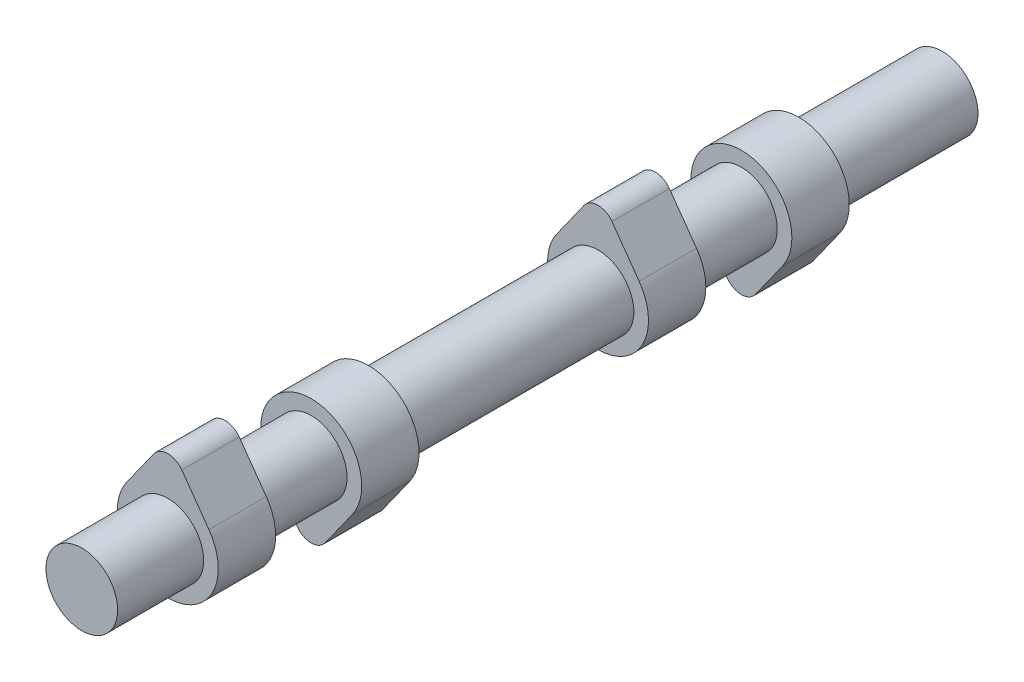
ISO-10303-21;
HEADER;
FILE_DESCRIPTION(('STEP AP214'),'2;1');
FILE_NAME('part.step','',(''),(''),'','','');
FILE_SCHEMA(('AUTOMOTIVE_DESIGN { 1 0 10303 214 1 1 1 1 }'));
ENDSEC;
DATA;
#1=APPLICATION_CONTEXT('core data for automotive mechanical design processes');
#2=APPLICATION_PROTOCOL_DEFINITION('international standard','automotive_design',2000,#1);
#3=PRODUCT_CONTEXT('',#1,'mechanical');
#4=PRODUCT('Part','Part','',(#3));
#5=PRODUCT_RELATED_PRODUCT_CATEGORY('part','',(#4));
#6=PRODUCT_DEFINITION_FORMATION('','',#4);
#7=PRODUCT_DEFINITION_CONTEXT('part definition',#1,'design');
#8=PRODUCT_DEFINITION('design','',#6,#7);
#9=PRODUCT_DEFINITION_SHAPE('','',#8);
#10=(LENGTH_UNIT() NAMED_UNIT(*) SI_UNIT(.MILLI.,.METRE.));
#11=(NAMED_UNIT(*) PLANE_ANGLE_UNIT() SI_UNIT($,.RADIAN.));
#12=(NAMED_UNIT(*) SI_UNIT($,.STERADIAN.) SOLID_ANGLE_UNIT());
#13=UNCERTAINTY_MEASURE_WITH_UNIT(LENGTH_MEASURE(1.E-05),#10,'distance_accuracy_value','');
#14=(GEOMETRIC_REPRESENTATION_CONTEXT(3) GLOBAL_UNCERTAINTY_ASSIGNED_CONTEXT((#13)) GLOBAL_UNIT_ASSIGNED_CONTEXT((#10,
#11,#12)) REPRESENTATION_CONTEXT('',''));
#15=CARTESIAN_POINT('',(0.,0.,0.));
#16=DIRECTION('',(0.,0.,1.));
#17=DIRECTION('',(1.,0.,0.));
#18=AXIS2_PLACEMENT_3D('',#15,#16,#17);
#19=CARTESIAN_POINT('',(0.,0.,150.));
#20=DIRECTION('',(0.,0.,-1.));
#21=DIRECTION('',(-1.,0.,0.));
#22=AXIS2_PLACEMENT_3D('',#19,#20,#21);
#23=CYLINDRICAL_SURFACE('',#22,6.25);
#24=CARTESIAN_POINT('',(0.,0.,50.));
#25=DIRECTION('',(0.,0.,-1.));
#26=DIRECTION('',(-1.,0.,0.));
#27=AXIS2_PLACEMENT_3D('',#24,#25,#26);
#28=CIRCLE('',#27,6.25);
#29=CARTESIAN_POINT('',(-6.25,0.,50.));
#30=VERTEX_POINT('',#29);
#31=EDGE_CURVE('E218',#30,#30,#28,.T.);
#32=ORIENTED_EDGE('',*,*,#31,.T.);
#33=EDGE_LOOP('',(#32));
#34=FACE_BOUND('',#33,.T.);
#35=CARTESIAN_POINT('',(0.,0.,35.));
#36=DIRECTION('',(0.,0.,-1.));
#37=DIRECTION('',(-1.,0.,0.));
#38=AXIS2_PLACEMENT_3D('',#35,#36,#37);
#39=CIRCLE('',#38,6.25);
#40=CARTESIAN_POINT('',(-6.25,0.,35.));
#41=VERTEX_POINT('',#40);
#42=EDGE_CURVE('E11',#41,#41,#39,.T.);
#43=ORIENTED_EDGE('',*,*,#42,.F.);
#44=EDGE_LOOP('',(#43));
#45=FACE_BOUND('',#44,.T.);
#46=ADVANCED_FACE('F33',(#34,#45),#23,.T.);
#47=CARTESIAN_POINT('',(0.,0.,100.));
#48=DIRECTION('',(0.,0.,-1.));
#49=DIRECTION('',(-1.,0.,0.));
#50=AXIS2_PLACEMENT_3D('',#47,#48,#49);
#51=CIRCLE('',#50,6.25);
#52=CARTESIAN_POINT('',(-6.25,0.,100.));
#53=VERTEX_POINT('',#52);
#54=EDGE_CURVE('E219',#53,#53,#51,.T.);
#55=ORIENTED_EDGE('',*,*,#54,.T.);
#56=EDGE_LOOP('',(#55));
#57=FACE_BOUND('',#56,.T.);
#58=CARTESIAN_POINT('',(0.,0.,60.));
#59=DIRECTION('',(0.,0.,-1.));
#60=DIRECTION('',(-1.,0.,0.));
#61=AXIS2_PLACEMENT_3D('',#58,#59,#60);
#62=CIRCLE('',#61,6.25);
#63=CARTESIAN_POINT('',(-6.25,0.,60.));
#64=VERTEX_POINT('',#63);
#65=EDGE_CURVE('E43',#64,#64,#62,.T.);
#66=ORIENTED_EDGE('',*,*,#65,.F.);
#67=EDGE_LOOP('',(#66));
#68=FACE_BOUND('',#67,.T.);
#69=ADVANCED_FACE('F331',(#57,#68),#23,.T.);
#70=CARTESIAN_POINT('',(0.,0.,125.));
#71=DIRECTION('',(0.,0.,1.));
#72=DIRECTION('',(1.,0.,0.));
#73=AXIS2_PLACEMENT_3D('',#70,#71,#72);
#74=CIRCLE('',#73,6.25);
#75=CARTESIAN_POINT('',(6.25,0.,125.));
#76=VERTEX_POINT('',#75);
#77=EDGE_CURVE('E283',#76,#76,#74,.T.);
#78=ORIENTED_EDGE('',*,*,#77,.F.);
#79=EDGE_LOOP('',(#78));
#80=FACE_BOUND('',#79,.T.);
#81=CARTESIAN_POINT('',(0.,0.,110.));
#82=DIRECTION('',(0.,0.,-1.));
#83=DIRECTION('',(-1.,0.,0.));
#84=AXIS2_PLACEMENT_3D('',#81,#82,#83);
#85=CIRCLE('',#84,6.25);
#86=CARTESIAN_POINT('',(-6.25,0.,110.));
#87=VERTEX_POINT('',#86);
#88=EDGE_CURVE('E288',#87,#87,#85,.T.);
#89=ORIENTED_EDGE('',*,*,#88,.F.);
#90=EDGE_LOOP('',(#89));
#91=FACE_BOUND('',#90,.T.);
#92=ADVANCED_FACE('F335',(#80,#91),#23,.T.);
#93=CARTESIAN_POINT('',(0.,10.,125.));
#94=DIRECTION('',(0.,0.,1.));
#95=DIRECTION('',(1.,0.,0.));
#96=AXIS2_PLACEMENT_3D('',#93,#94,#95);
#97=CYLINDRICAL_SURFACE('',#96,3.);
#98=CARTESIAN_POINT('',(0.,10.,135.));
#99=DIRECTION('',(0.,0.,1.));
#100=DIRECTION('',(1.,0.,0.));
#101=AXIS2_PLACEMENT_3D('',#98,#99,#100);
#102=CIRCLE('',#101,3.);
#103=CARTESIAN_POINT('',(2.44384942252996,11.74,135.));
#104=VERTEX_POINT('',#103);
#105=CARTESIAN_POINT('',(-2.44384942252996,11.74,135.));
#106=VERTEX_POINT('',#105);
#107=EDGE_CURVE('E255',#104,#106,#102,.T.);
#108=ORIENTED_EDGE('',*,*,#107,.F.);
#109=DIRECTION('',(0.,0.,1.));
#110=VECTOR('',#109,1.);
#111=CARTESIAN_POINT('',(2.44384942252996,11.74,125.));
#112=LINE('',#111,#110);
#113=CARTESIAN_POINT('',(2.44384942252996,11.74,125.));
#114=VERTEX_POINT('',#113);
#115=EDGE_CURVE('E51',#114,#104,#112,.T.);
#116=ORIENTED_EDGE('',*,*,#115,.F.);
#117=CARTESIAN_POINT('',(0.,10.,125.));
#118=DIRECTION('',(0.,0.,1.));
#119=DIRECTION('',(1.,0.,0.));
#120=AXIS2_PLACEMENT_3D('',#117,#118,#119);
#121=CIRCLE('',#120,3.);
#122=CARTESIAN_POINT('',(-2.44384942252996,11.74,125.));
#123=VERTEX_POINT('',#122);
#124=EDGE_CURVE('E256',#114,#123,#121,.T.);
#125=ORIENTED_EDGE('',*,*,#124,.T.);
#126=DIRECTION('',(0.,0.,1.));
#127=VECTOR('',#126,1.);
#128=CARTESIAN_POINT('',(-2.44384942252996,11.74,125.));
#129=LINE('',#128,#127);
#130=EDGE_CURVE('E80',#123,#106,#129,.T.);
#131=ORIENTED_EDGE('',*,*,#130,.T.);
#132=EDGE_LOOP('',(#108,#116,#125,#131));
#133=FACE_BOUND('',#132,.T.);
#134=ADVANCED_FACE('F363',(#133),#97,.T.);
#135=CARTESIAN_POINT('',(2.44384942252996,11.74,125.));
#136=DIRECTION('',(0.814616474176652,0.58,0.));
#137=DIRECTION('',(-0.58,0.814616474176652,0.));
#138=AXIS2_PLACEMENT_3D('',#135,#136,#137);
#139=PLANE('',#138);
#140=DIRECTION('',(-0.58,0.814616474176652,0.));
#141=VECTOR('',#140,1.);
#142=CARTESIAN_POINT('',(2.44384942252996,11.74,135.));
#143=LINE('',#142,#141);
#144=CARTESIAN_POINT('',(7.16862497275454,5.104,135.));
#145=VERTEX_POINT('',#144);
#146=EDGE_CURVE('E259',#145,#104,#143,.T.);
#147=ORIENTED_EDGE('',*,*,#146,.F.);
#148=DIRECTION('',(0.,0.,1.));
#149=VECTOR('',#148,1.);
#150=CARTESIAN_POINT('',(7.16862497275454,5.104,125.));
#151=LINE('',#150,#149);
#152=CARTESIAN_POINT('',(7.16862497275454,5.104,125.));
#153=VERTEX_POINT('',#152);
#154=EDGE_CURVE('E69',#153,#145,#151,.T.);
#155=ORIENTED_EDGE('',*,*,#154,.F.);
#156=DIRECTION('',(-0.58,0.814616474176652,0.));
#157=VECTOR('',#156,1.);
#158=CARTESIAN_POINT('',(2.44384942252996,11.74,125.));
#159=LINE('',#158,#157);
#160=EDGE_CURVE('E263',#153,#114,#159,.T.);
#161=ORIENTED_EDGE('',*,*,#160,.T.);
#162=ORIENTED_EDGE('',*,*,#115,.T.);
#163=EDGE_LOOP('',(#147,#155,#161,#162));
#164=FACE_BOUND('',#163,.T.);
#165=ADVANCED_FACE('F368',(#164),#139,.T.);
#166=CARTESIAN_POINT('',(0.,0.,125.));
#167=DIRECTION('',(0.,0.,1.));
#168=DIRECTION('',(1.,0.,0.));
#169=AXIS2_PLACEMENT_3D('',#166,#167,#168);
#170=CYLINDRICAL_SURFACE('',#169,8.8);
#171=CARTESIAN_POINT('',(0.,0.,135.));
#172=DIRECTION('',(0.,0.,1.));
#173=DIRECTION('',(1.,0.,0.));
#174=AXIS2_PLACEMENT_3D('',#171,#172,#173);
#175=CIRCLE('',#174,8.8);
#176=CARTESIAN_POINT('',(-7.16862497275454,5.104,135.));
#177=VERTEX_POINT('',#176);
#178=EDGE_CURVE('E270',#177,#145,#175,.T.);
#179=ORIENTED_EDGE('',*,*,#178,.F.);
#180=DIRECTION('',(0.,0.,1.));
#181=VECTOR('',#180,1.);
#182=CARTESIAN_POINT('',(-7.16862497275454,5.104,125.));
#183=LINE('',#182,#181);
#184=CARTESIAN_POINT('',(-7.16862497275454,5.104,125.));
#185=VERTEX_POINT('',#184);
#186=EDGE_CURVE('E277',#185,#177,#183,.T.);
#187=ORIENTED_EDGE('',*,*,#186,.F.);
#188=CARTESIAN_POINT('',(0.,0.,125.));
#189=DIRECTION('',(0.,0.,1.));
#190=DIRECTION('',(1.,0.,0.));
#191=AXIS2_PLACEMENT_3D('',#188,#189,#190);
#192=CIRCLE('',#191,8.8);
#193=EDGE_CURVE('E261',#185,#153,#192,.T.);
#194=ORIENTED_EDGE('',*,*,#193,.T.);
#195=ORIENTED_EDGE('',*,*,#154,.T.);
#196=EDGE_LOOP('',(#179,#187,#194,#195));
#197=FACE_BOUND('',#196,.T.);
#198=ADVANCED_FACE('F408',(#197),#170,.T.);
#199=CARTESIAN_POINT('',(-2.44384942252996,11.74,125.));
#200=DIRECTION('',(-0.814616474176652,0.58,0.));
#201=DIRECTION('',(-0.58,-0.814616474176652,0.));
#202=AXIS2_PLACEMENT_3D('',#199,#200,#201);
#203=PLANE('',#202);
#204=DIRECTION('',(-0.58,-0.814616474176652,0.));
#205=VECTOR('',#204,1.);
#206=CARTESIAN_POINT('',(-2.44384942252996,11.74,135.));
#207=LINE('',#206,#205);
#208=EDGE_CURVE('E267',#106,#177,#207,.T.);
#209=ORIENTED_EDGE('',*,*,#208,.F.);
#210=ORIENTED_EDGE('',*,*,#130,.F.);
#211=DIRECTION('',(-0.58,-0.814616474176652,0.));
#212=VECTOR('',#211,1.);
#213=CARTESIAN_POINT('',(-2.44384942252996,11.74,125.));
#214=LINE('',#213,#212);
#215=EDGE_CURVE('E258',#123,#185,#214,.T.);
#216=ORIENTED_EDGE('',*,*,#215,.T.);
#217=ORIENTED_EDGE('',*,*,#186,.T.);
#218=EDGE_LOOP('',(#209,#210,#216,#217));
#219=FACE_BOUND('',#218,.T.);
#220=ADVANCED_FACE('F401',(#219),#203,.T.);
#221=CARTESIAN_POINT('',(0.,10.,125.));
#222=DIRECTION('',(0.,0.,1.));
#223=DIRECTION('',(1.,0.,0.));
#224=AXIS2_PLACEMENT_3D('',#221,#222,#223);
#225=PLANE('',#224);
#226=ORIENTED_EDGE('',*,*,#77,.T.);
#227=EDGE_LOOP('',(#226));
#228=FACE_BOUND('',#227,.T.);
#229=ORIENTED_EDGE('',*,*,#124,.F.);
#230=ORIENTED_EDGE('',*,*,#160,.F.);
#231=ORIENTED_EDGE('',*,*,#193,.F.);
#232=ORIENTED_EDGE('',*,*,#215,.F.);
#233=EDGE_LOOP('',(#229,#230,#231,#232));
#234=FACE_BOUND('',#233,.T.);
#235=ADVANCED_FACE('F398',(#228,#234),#225,.F.);
#236=CARTESIAN_POINT('',(0.,10.,135.));
#237=DIRECTION('',(0.,0.,1.));
#238=DIRECTION('',(1.,0.,0.));
#239=AXIS2_PLACEMENT_3D('',#236,#237,#238);
#240=PLANE('',#239);
#241=CARTESIAN_POINT('',(0.,0.,135.));
#242=DIRECTION('',(0.,0.,1.));
#243=DIRECTION('',(1.,0.,0.));
#244=AXIS2_PLACEMENT_3D('',#241,#242,#243);
#245=CIRCLE('',#244,6.25);
#246=CARTESIAN_POINT('',(6.25,0.,135.));
#247=VERTEX_POINT('',#246);
#248=EDGE_CURVE('E252',#247,#247,#245,.T.);
#249=ORIENTED_EDGE('',*,*,#248,.F.);
#250=EDGE_LOOP('',(#249));
#251=FACE_BOUND('',#250,.T.);
#252=ORIENTED_EDGE('',*,*,#107,.T.);
#253=ORIENTED_EDGE('',*,*,#208,.T.);
#254=ORIENTED_EDGE('',*,*,#178,.T.);
#255=ORIENTED_EDGE('',*,*,#146,.T.);
#256=EDGE_LOOP('',(#252,#253,#254,#255));
#257=FACE_BOUND('',#256,.T.);
#258=ADVANCED_FACE('F349',(#251,#257),#240,.T.);
#259=CARTESIAN_POINT('',(0.,0.,150.));
#260=DIRECTION('',(0.,0.,1.));
#261=DIRECTION('',(1.,0.,0.));
#262=AXIS2_PLACEMENT_3D('',#259,#260,#261);
#263=PLANE('',#262);
#264=CARTESIAN_POINT('',(0.,0.,150.));
#265=DIRECTION('',(0.,0.,1.));
#266=DIRECTION('',(1.,0.,0.));
#267=AXIS2_PLACEMENT_3D('',#264,#265,#266);
#268=CIRCLE('',#267,6.25);
#269=CARTESIAN_POINT('',(6.25,0.,150.));
#270=VERTEX_POINT('',#269);
#271=EDGE_CURVE('E280',#270,#270,#268,.T.);
#272=ORIENTED_EDGE('',*,*,#271,.T.);
#273=EDGE_LOOP('',(#272));
#274=FACE_BOUND('',#273,.T.);
#275=ADVANCED_FACE('F339',(#274),#263,.T.);
#276=ORIENTED_EDGE('',*,*,#248,.T.);
#277=EDGE_LOOP('',(#276));
#278=FACE_BOUND('',#277,.T.);
#279=ORIENTED_EDGE('',*,*,#271,.F.);
#280=EDGE_LOOP('',(#279));
#281=FACE_BOUND('',#280,.T.);
#282=ADVANCED_FACE('F35',(#278,#281),#23,.T.);
#283=CARTESIAN_POINT('',(0.,-10.,100.));
#284=DIRECTION('',(0.,0.,-1.));
#285=DIRECTION('',(-1.,0.,0.));
#286=AXIS2_PLACEMENT_3D('',#283,#284,#285);
#287=PLANE('',#286);
#288=CARTESIAN_POINT('',(0.,-10.,100.));
#289=DIRECTION('',(0.,0.,-1.));
#290=DIRECTION('',(-1.,0.,0.));
#291=AXIS2_PLACEMENT_3D('',#288,#289,#290);
#292=CIRCLE('',#291,3.);
#293=CARTESIAN_POINT('',(2.44384942252996,-11.74,100.));
#294=VERTEX_POINT('',#293);
#295=CARTESIAN_POINT('',(-2.44384942252996,-11.74,100.));
#296=VERTEX_POINT('',#295);
#297=EDGE_CURVE('E223',#294,#296,#292,.T.);
#298=ORIENTED_EDGE('',*,*,#297,.T.);
#299=DIRECTION('',(-0.58,0.814616474176652,0.));
#300=VECTOR('',#299,1.);
#301=CARTESIAN_POINT('',(-2.44384942252996,-11.74,100.));
#302=LINE('',#301,#300);
#303=CARTESIAN_POINT('',(-7.16862497275454,-5.104,100.));
#304=VERTEX_POINT('',#303);
#305=EDGE_CURVE('E226',#296,#304,#302,.T.);
#306=ORIENTED_EDGE('',*,*,#305,.T.);
#307=CARTESIAN_POINT('',(0.,0.,100.));
#308=DIRECTION('',(0.,0.,-1.));
#309=DIRECTION('',(-1.,0.,0.));
#310=AXIS2_PLACEMENT_3D('',#307,#308,#309);
#311=CIRCLE('',#310,8.8);
#312=CARTESIAN_POINT('',(7.16862497275454,-5.104,100.));
#313=VERTEX_POINT('',#312);
#314=EDGE_CURVE('E229',#304,#313,#311,.T.);
#315=ORIENTED_EDGE('',*,*,#314,.T.);
#316=DIRECTION('',(-0.58,-0.814616474176652,0.));
#317=VECTOR('',#316,1.);
#318=CARTESIAN_POINT('',(2.44384942252996,-11.74,100.));
#319=LINE('',#318,#317);
#320=EDGE_CURVE('E231',#313,#294,#319,.T.);
#321=ORIENTED_EDGE('',*,*,#320,.T.);
#322=EDGE_LOOP('',(#298,#306,#315,#321));
#323=FACE_BOUND('',#322,.T.);
#324=ORIENTED_EDGE('',*,*,#54,.F.);
#325=EDGE_LOOP('',(#324));
#326=FACE_BOUND('',#325,.T.);
#327=ADVANCED_FACE('F338',(#323,#326),#287,.T.);
#328=CARTESIAN_POINT('',(0.,-10.,110.));
#329=DIRECTION('',(0.,0.,-1.));
#330=DIRECTION('',(-1.,0.,0.));
#331=AXIS2_PLACEMENT_3D('',#328,#329,#330);
#332=PLANE('',#331);
#333=CARTESIAN_POINT('',(0.,-10.,110.));
#334=DIRECTION('',(0.,0.,-1.));
#335=DIRECTION('',(-1.,0.,0.));
#336=AXIS2_PLACEMENT_3D('',#333,#334,#335);
#337=CIRCLE('',#336,3.);
#338=CARTESIAN_POINT('',(2.44384942252996,-11.74,110.));
#339=VERTEX_POINT('',#338);
#340=CARTESIAN_POINT('',(-2.44384942252996,-11.74,110.));
#341=VERTEX_POINT('',#340);
#342=EDGE_CURVE('E222',#339,#341,#337,.T.);
#343=ORIENTED_EDGE('',*,*,#342,.F.);
#344=DIRECTION('',(-0.58,-0.814616474176652,0.));
#345=VECTOR('',#344,1.);
#346=CARTESIAN_POINT('',(2.44384942252996,-11.74,110.));
#347=LINE('',#346,#345);
#348=CARTESIAN_POINT('',(7.16862497275454,-5.104,110.));
#349=VERTEX_POINT('',#348);
#350=EDGE_CURVE('E227',#349,#339,#347,.T.);
#351=ORIENTED_EDGE('',*,*,#350,.F.);
#352=CARTESIAN_POINT('',(0.,0.,110.));
#353=DIRECTION('',(0.,0.,-1.));
#354=DIRECTION('',(-1.,0.,0.));
#355=AXIS2_PLACEMENT_3D('',#352,#353,#354);
#356=CIRCLE('',#355,8.8);
#357=CARTESIAN_POINT('',(-7.16862497275454,-5.104,110.));
#358=VERTEX_POINT('',#357);
#359=EDGE_CURVE('E238',#358,#349,#356,.T.);
#360=ORIENTED_EDGE('',*,*,#359,.F.);
#361=DIRECTION('',(-0.58,0.814616474176652,0.));
#362=VECTOR('',#361,1.);
#363=CARTESIAN_POINT('',(-2.44384942252996,-11.74,110.));
#364=LINE('',#363,#362);
#365=EDGE_CURVE('E236',#341,#358,#364,.T.);
#366=ORIENTED_EDGE('',*,*,#365,.F.);
#367=EDGE_LOOP('',(#343,#351,#360,#366));
#368=FACE_BOUND('',#367,.T.);
#369=ORIENTED_EDGE('',*,*,#88,.T.);
#370=EDGE_LOOP('',(#369));
#371=FACE_BOUND('',#370,.T.);
#372=ADVANCED_FACE('F346',(#368,#371),#332,.F.);
#373=CARTESIAN_POINT('',(0.,-10.,100.));
#374=DIRECTION('',(0.,0.,1.));
#375=DIRECTION('',(1.,0.,0.));
#376=AXIS2_PLACEMENT_3D('',#373,#374,#375);
#377=CYLINDRICAL_SURFACE('',#376,3.);
#378=ORIENTED_EDGE('',*,*,#342,.T.);
#379=DIRECTION('',(0.,0.,1.));
#380=VECTOR('',#379,1.);
#381=CARTESIAN_POINT('',(-2.44384942252996,-11.74,100.));
#382=LINE('',#381,#380);
#383=EDGE_CURVE('E249',#296,#341,#382,.T.);
#384=ORIENTED_EDGE('',*,*,#383,.F.);
#385=ORIENTED_EDGE('',*,*,#297,.F.);
#386=DIRECTION('',(0.,0.,1.));
#387=VECTOR('',#386,1.);
#388=CARTESIAN_POINT('',(2.44384942252996,-11.74,100.));
#389=LINE('',#388,#387);
#390=EDGE_CURVE('E233',#294,#339,#389,.T.);
#391=ORIENTED_EDGE('',*,*,#390,.T.);
#392=EDGE_LOOP('',(#378,#384,#385,#391));
#393=FACE_BOUND('',#392,.T.);
#394=ADVANCED_FACE('F375',(#393),#377,.T.);
#395=CARTESIAN_POINT('',(-2.44384942252996,-11.74,100.));
#396=DIRECTION('',(0.814616474176652,0.58,0.));
#397=DIRECTION('',(-0.58,0.814616474176652,0.));
#398=AXIS2_PLACEMENT_3D('',#395,#396,#397);
#399=PLANE('',#398);
#400=ORIENTED_EDGE('',*,*,#365,.T.);
#401=DIRECTION('',(0.,0.,1.));
#402=VECTOR('',#401,1.);
#403=CARTESIAN_POINT('',(-7.16862497275454,-5.104,100.));
#404=LINE('',#403,#402);
#405=EDGE_CURVE('E246',#304,#358,#404,.T.);
#406=ORIENTED_EDGE('',*,*,#405,.F.);
#407=ORIENTED_EDGE('',*,*,#305,.F.);
#408=ORIENTED_EDGE('',*,*,#383,.T.);
#409=EDGE_LOOP('',(#400,#406,#407,#408));
#410=FACE_BOUND('',#409,.T.);
#411=ADVANCED_FACE('F381',(#410),#399,.F.);
#412=CARTESIAN_POINT('',(0.,0.,100.));
#413=DIRECTION('',(0.,0.,1.));
#414=DIRECTION('',(1.,0.,0.));
#415=AXIS2_PLACEMENT_3D('',#412,#413,#414);
#416=CYLINDRICAL_SURFACE('',#415,8.8);
#417=ORIENTED_EDGE('',*,*,#359,.T.);
#418=DIRECTION('',(0.,0.,1.));
#419=VECTOR('',#418,1.);
#420=CARTESIAN_POINT('',(7.16862497275454,-5.104,100.));
#421=LINE('',#420,#419);
#422=EDGE_CURVE('E243',#313,#349,#421,.T.);
#423=ORIENTED_EDGE('',*,*,#422,.F.);
#424=ORIENTED_EDGE('',*,*,#314,.F.);
#425=ORIENTED_EDGE('',*,*,#405,.T.);
#426=EDGE_LOOP('',(#417,#423,#424,#425));
#427=FACE_BOUND('',#426,.T.);
#428=ADVANCED_FACE('F390',(#427),#416,.T.);
#429=CARTESIAN_POINT('',(2.44384942252996,-11.74,100.));
#430=DIRECTION('',(-0.814616474176652,0.58,0.));
#431=DIRECTION('',(-0.58,-0.814616474176652,0.));
#432=AXIS2_PLACEMENT_3D('',#429,#430,#431);
#433=PLANE('',#432);
#434=ORIENTED_EDGE('',*,*,#350,.T.);
#435=ORIENTED_EDGE('',*,*,#390,.F.);
#436=ORIENTED_EDGE('',*,*,#320,.F.);
#437=ORIENTED_EDGE('',*,*,#422,.T.);
#438=EDGE_LOOP('',(#434,#435,#436,#437));
#439=FACE_BOUND('',#438,.T.);
#440=ADVANCED_FACE('F387',(#439),#433,.F.);
#441=CARTESIAN_POINT('',(0.,10.,50.));
#442=DIRECTION('',(0.,0.,1.));
#443=DIRECTION('',(1.,0.,0.));
#444=AXIS2_PLACEMENT_3D('',#441,#442,#443);
#445=CYLINDRICAL_SURFACE('',#444,3.);
#446=CARTESIAN_POINT('',(0.,10.,60.));
#447=DIRECTION('',(0.,0.,-1.));
#448=DIRECTION('',(-1.,0.,0.));
#449=AXIS2_PLACEMENT_3D('',#446,#447,#448);
#450=CIRCLE('',#449,3.);
#451=CARTESIAN_POINT('',(-2.44384942252996,11.74,60.));
#452=VERTEX_POINT('',#451);
#453=CARTESIAN_POINT('',(2.44384942252996,11.74,60.));
#454=VERTEX_POINT('',#453);
#455=EDGE_CURVE('E184',#452,#454,#450,.T.);
#456=ORIENTED_EDGE('',*,*,#455,.T.);
#457=DIRECTION('',(0.,0.,1.));
#458=VECTOR('',#457,1.);
#459=CARTESIAN_POINT('',(2.44384942252996,11.74,50.));
#460=LINE('',#459,#458);
#461=CARTESIAN_POINT('',(2.44384942252996,11.74,50.));
#462=VERTEX_POINT('',#461);
#463=EDGE_CURVE('E215',#462,#454,#460,.T.);
#464=ORIENTED_EDGE('',*,*,#463,.F.);
#465=CARTESIAN_POINT('',(0.,10.,50.));
#466=DIRECTION('',(0.,0.,-1.));
#467=DIRECTION('',(-1.,0.,0.));
#468=AXIS2_PLACEMENT_3D('',#465,#466,#467);
#469=CIRCLE('',#468,3.);
#470=CARTESIAN_POINT('',(-2.44384942252996,11.74,50.));
#471=VERTEX_POINT('',#470);
#472=EDGE_CURVE('E189',#471,#462,#469,.T.);
#473=ORIENTED_EDGE('',*,*,#472,.F.);
#474=DIRECTION('',(0.,0.,1.));
#475=VECTOR('',#474,1.);
#476=CARTESIAN_POINT('',(-2.44384942252996,11.74,50.));
#477=LINE('',#476,#475);
#478=EDGE_CURVE('E199',#471,#452,#477,.T.);
#479=ORIENTED_EDGE('',*,*,#478,.T.);
#480=EDGE_LOOP('',(#456,#464,#473,#479));
#481=FACE_BOUND('',#480,.T.);
#482=ADVANCED_FACE('F310',(#481),#445,.T.);
#483=CARTESIAN_POINT('',(2.44384942252996,11.74,50.));
#484=DIRECTION('',(-0.814616474176652,-0.58,0.));
#485=DIRECTION('',(0.58,-0.814616474176652,0.));
#486=AXIS2_PLACEMENT_3D('',#483,#484,#485);
#487=PLANE('',#486);
#488=DIRECTION('',(0.58,-0.814616474176652,0.));
#489=VECTOR('',#488,1.);
#490=CARTESIAN_POINT('',(2.44384942252996,11.74,60.));
#491=LINE('',#490,#489);
#492=CARTESIAN_POINT('',(7.16862497275454,5.104,60.));
#493=VERTEX_POINT('',#492);
#494=EDGE_CURVE('E202',#454,#493,#491,.T.);
#495=ORIENTED_EDGE('',*,*,#494,.T.);
#496=DIRECTION('',(0.,0.,1.));
#497=VECTOR('',#496,1.);
#498=CARTESIAN_POINT('',(7.16862497275454,5.104,50.));
#499=LINE('',#498,#497);
#500=CARTESIAN_POINT('',(7.16862497275454,5.104,50.));
#501=VERTEX_POINT('',#500);
#502=EDGE_CURVE('E212',#501,#493,#499,.T.);
#503=ORIENTED_EDGE('',*,*,#502,.F.);
#504=DIRECTION('',(0.58,-0.814616474176652,0.));
#505=VECTOR('',#504,1.);
#506=CARTESIAN_POINT('',(2.44384942252996,11.74,50.));
#507=LINE('',#506,#505);
#508=EDGE_CURVE('E192',#462,#501,#507,.T.);
#509=ORIENTED_EDGE('',*,*,#508,.F.);
#510=ORIENTED_EDGE('',*,*,#463,.T.);
#511=EDGE_LOOP('',(#495,#503,#509,#510));
#512=FACE_BOUND('',#511,.T.);
#513=ADVANCED_FACE('F313',(#512),#487,.F.);
#514=CARTESIAN_POINT('',(0.,0.,50.));
#515=DIRECTION('',(0.,0.,1.));
#516=DIRECTION('',(1.,0.,0.));
#517=AXIS2_PLACEMENT_3D('',#514,#515,#516);
#518=CYLINDRICAL_SURFACE('',#517,8.8);
#519=CARTESIAN_POINT('',(0.,0.,60.));
#520=DIRECTION('',(0.,0.,-1.));
#521=DIRECTION('',(-1.,0.,0.));
#522=AXIS2_PLACEMENT_3D('',#519,#520,#521);
#523=CIRCLE('',#522,8.8);
#524=CARTESIAN_POINT('',(-7.16862497275454,5.104,60.));
#525=VERTEX_POINT('',#524);
#526=EDGE_CURVE('E204',#493,#525,#523,.T.);
#527=ORIENTED_EDGE('',*,*,#526,.T.);
#528=DIRECTION('',(0.,0.,1.));
#529=VECTOR('',#528,1.);
#530=CARTESIAN_POINT('',(-7.16862497275454,5.104,50.));
#531=LINE('',#530,#529);
#532=CARTESIAN_POINT('',(-7.16862497275454,5.104,50.));
#533=VERTEX_POINT('',#532);
#534=EDGE_CURVE('E209',#533,#525,#531,.T.);
#535=ORIENTED_EDGE('',*,*,#534,.F.);
#536=CARTESIAN_POINT('',(0.,0.,50.));
#537=DIRECTION('',(0.,0.,-1.));
#538=DIRECTION('',(-1.,0.,0.));
#539=AXIS2_PLACEMENT_3D('',#536,#537,#538);
#540=CIRCLE('',#539,8.8);
#541=EDGE_CURVE('E195',#501,#533,#540,.T.);
#542=ORIENTED_EDGE('',*,*,#541,.F.);
#543=ORIENTED_EDGE('',*,*,#502,.T.);
#544=EDGE_LOOP('',(#527,#535,#542,#543));
#545=FACE_BOUND('',#544,.T.);
#546=ADVANCED_FACE('F318',(#545),#518,.T.);
#547=CARTESIAN_POINT('',(-7.16862497275454,5.104,50.));
#548=DIRECTION('',(0.814616474176652,-0.58,0.));
#549=DIRECTION('',(0.58,0.814616474176652,0.));
#550=AXIS2_PLACEMENT_3D('',#547,#548,#549);
#551=PLANE('',#550);
#552=DIRECTION('',(0.58,0.814616474176652,0.));
#553=VECTOR('',#552,1.);
#554=CARTESIAN_POINT('',(-7.16862497275454,5.104,60.));
#555=LINE('',#554,#553);
#556=EDGE_CURVE('E193',#525,#452,#555,.T.);
#557=ORIENTED_EDGE('',*,*,#556,.T.);
#558=ORIENTED_EDGE('',*,*,#478,.F.);
#559=DIRECTION('',(0.58,0.814616474176652,0.));
#560=VECTOR('',#559,1.);
#561=CARTESIAN_POINT('',(-7.16862497275454,5.104,50.));
#562=LINE('',#561,#560);
#563=EDGE_CURVE('E197',#533,#471,#562,.T.);
#564=ORIENTED_EDGE('',*,*,#563,.F.);
#565=ORIENTED_EDGE('',*,*,#534,.T.);
#566=EDGE_LOOP('',(#557,#558,#564,#565));
#567=FACE_BOUND('',#566,.T.);
#568=ADVANCED_FACE('F302',(#567),#551,.F.);
#569=CARTESIAN_POINT('',(0.,10.,50.));
#570=DIRECTION('',(0.,0.,-1.));
#571=DIRECTION('',(-1.,0.,0.));
#572=AXIS2_PLACEMENT_3D('',#569,#570,#571);
#573=PLANE('',#572);
#574=ORIENTED_EDGE('',*,*,#31,.F.);
#575=EDGE_LOOP('',(#574));
#576=FACE_BOUND('',#575,.T.);
#577=ORIENTED_EDGE('',*,*,#472,.T.);
#578=ORIENTED_EDGE('',*,*,#508,.T.);
#579=ORIENTED_EDGE('',*,*,#541,.T.);
#580=ORIENTED_EDGE('',*,*,#563,.T.);
#581=EDGE_LOOP('',(#577,#578,#579,#580));
#582=FACE_BOUND('',#581,.T.);
#583=ADVANCED_FACE('F298',(#576,#582),#573,.T.);
#584=CARTESIAN_POINT('',(0.,10.,60.));
#585=DIRECTION('',(0.,0.,-1.));
#586=DIRECTION('',(-1.,0.,0.));
#587=AXIS2_PLACEMENT_3D('',#584,#585,#586);
#588=PLANE('',#587);
#589=ORIENTED_EDGE('',*,*,#65,.T.);
#590=EDGE_LOOP('',(#589));
#591=FACE_BOUND('',#590,.T.);
#592=ORIENTED_EDGE('',*,*,#455,.F.);
#593=ORIENTED_EDGE('',*,*,#556,.F.);
#594=ORIENTED_EDGE('',*,*,#526,.F.);
#595=ORIENTED_EDGE('',*,*,#494,.F.);
#596=EDGE_LOOP('',(#592,#593,#594,#595));
#597=FACE_BOUND('',#596,.T.);
#598=ADVANCED_FACE('F301',(#591,#597),#588,.F.);
#599=CARTESIAN_POINT('',(0.,-10.,25.));
#600=DIRECTION('',(0.,0.,1.));
#601=DIRECTION('',(1.,0.,0.));
#602=AXIS2_PLACEMENT_3D('',#599,#600,#601);
#603=CYLINDRICAL_SURFACE('',#602,3.);
#604=CARTESIAN_POINT('',(0.,-10.,35.));
#605=DIRECTION('',(0.,0.,-1.));
#606=DIRECTION('',(-1.,0.,0.));
#607=AXIS2_PLACEMENT_3D('',#604,#605,#606);
#608=CIRCLE('',#607,3.);
#609=CARTESIAN_POINT('',(2.44384942252996,-11.74,35.));
#610=VERTEX_POINT('',#609);
#611=CARTESIAN_POINT('',(-2.44384942252996,-11.74,35.));
#612=VERTEX_POINT('',#611);
#613=EDGE_CURVE('E181',#610,#612,#608,.T.);
#614=ORIENTED_EDGE('',*,*,#613,.T.);
#615=DIRECTION('',(0.,0.,1.));
#616=VECTOR('',#615,1.);
#617=CARTESIAN_POINT('',(-2.44384942252996,-11.74,25.));
#618=LINE('',#617,#616);
#619=CARTESIAN_POINT('',(-2.44384942252996,-11.74,25.));
#620=VERTEX_POINT('',#619);
#621=EDGE_CURVE('E161',#620,#612,#618,.T.);
#622=ORIENTED_EDGE('',*,*,#621,.F.);
#623=CARTESIAN_POINT('',(0.,-10.,25.));
#624=DIRECTION('',(0.,0.,-1.));
#625=DIRECTION('',(-1.,0.,0.));
#626=AXIS2_PLACEMENT_3D('',#623,#624,#625);
#627=CIRCLE('',#626,3.);
#628=CARTESIAN_POINT('',(2.44384942252996,-11.74,25.));
#629=VERTEX_POINT('',#628);
#630=EDGE_CURVE('E168',#629,#620,#627,.T.);
#631=ORIENTED_EDGE('',*,*,#630,.F.);
#632=DIRECTION('',(0.,0.,1.));
#633=VECTOR('',#632,1.);
#634=CARTESIAN_POINT('',(2.44384942252996,-11.74,25.));
#635=LINE('',#634,#633);
#636=EDGE_CURVE('E611',#629,#610,#635,.T.);
#637=ORIENTED_EDGE('',*,*,#636,.T.);
#638=EDGE_LOOP('',(#614,#622,#631,#637));
#639=FACE_BOUND('',#638,.T.);
#640=ADVANCED_FACE('F179',(#639),#603,.T.);
#641=CARTESIAN_POINT('',(-2.44384942252996,-11.74,25.));
#642=DIRECTION('',(0.814616474176652,0.58,0.));
#643=DIRECTION('',(-0.58,0.814616474176652,0.));
#644=AXIS2_PLACEMENT_3D('',#641,#642,#643);
#645=PLANE('',#644);
#646=DIRECTION('',(-0.58,0.814616474176652,0.));
#647=VECTOR('',#646,1.);
#648=CARTESIAN_POINT('',(-2.44384942252996,-11.74,35.));
#649=LINE('',#648,#647);
#650=CARTESIAN_POINT('',(-7.16862497275454,-5.104,35.));
#651=VERTEX_POINT('',#650);
#652=EDGE_CURVE('E602',#612,#651,#649,.T.);
#653=ORIENTED_EDGE('',*,*,#652,.T.);
#654=DIRECTION('',(0.,0.,1.));
#655=VECTOR('',#654,1.);
#656=CARTESIAN_POINT('',(-7.16862497275454,-5.104,25.));
#657=LINE('',#656,#655);
#658=CARTESIAN_POINT('',(-7.16862497275454,-5.104,25.));
#659=VERTEX_POINT('',#658);
#660=EDGE_CURVE('E164',#659,#651,#657,.T.);
#661=ORIENTED_EDGE('',*,*,#660,.F.);
#662=DIRECTION('',(-0.58,0.814616474176652,0.));
#663=VECTOR('',#662,1.);
#664=CARTESIAN_POINT('',(-2.44384942252996,-11.74,25.));
#665=LINE('',#664,#663);
#666=EDGE_CURVE('E157',#620,#659,#665,.T.);
#667=ORIENTED_EDGE('',*,*,#666,.F.);
#668=ORIENTED_EDGE('',*,*,#621,.T.);
#669=EDGE_LOOP('',(#653,#661,#667,#668));
#670=FACE_BOUND('',#669,.T.);
#671=ADVANCED_FACE('F159',(#670),#645,.F.);
#672=CARTESIAN_POINT('',(0.,0.,25.));
#673=DIRECTION('',(0.,0.,1.));
#674=DIRECTION('',(1.,0.,0.));
#675=AXIS2_PLACEMENT_3D('',#672,#673,#674);
#676=CYLINDRICAL_SURFACE('',#675,8.8);
#677=CARTESIAN_POINT('',(0.,0.,35.));
#678=DIRECTION('',(0.,0.,-1.));
#679=DIRECTION('',(-1.,0.,0.));
#680=AXIS2_PLACEMENT_3D('',#677,#678,#679);
#681=CIRCLE('',#680,8.8);
#682=CARTESIAN_POINT('',(7.16862497275454,-5.104,35.));
#683=VERTEX_POINT('',#682);
#684=EDGE_CURVE('E604',#651,#683,#681,.T.);
#685=ORIENTED_EDGE('',*,*,#684,.T.);
#686=DIRECTION('',(0.,0.,1.));
#687=VECTOR('',#686,1.);
#688=CARTESIAN_POINT('',(7.16862497275454,-5.104,25.));
#689=LINE('',#688,#687);
#690=CARTESIAN_POINT('',(7.16862497275454,-5.104,25.));
#691=VERTEX_POINT('',#690);
#692=EDGE_CURVE('E185',#691,#683,#689,.T.);
#693=ORIENTED_EDGE('',*,*,#692,.F.);
#694=CARTESIAN_POINT('',(0.,0.,25.));
#695=DIRECTION('',(0.,0.,-1.));
#696=DIRECTION('',(-1.,0.,0.));
#697=AXIS2_PLACEMENT_3D('',#694,#695,#696);
#698=CIRCLE('',#697,8.8);
#699=EDGE_CURVE('E167',#659,#691,#698,.T.);
#700=ORIENTED_EDGE('',*,*,#699,.F.);
#701=ORIENTED_EDGE('',*,*,#660,.T.);
#702=EDGE_LOOP('',(#685,#693,#700,#701));
#703=FACE_BOUND('',#702,.T.);
#704=ADVANCED_FACE('F555',(#703),#676,.T.);
#705=CARTESIAN_POINT('',(7.16862497275454,-5.104,25.));
#706=DIRECTION('',(-0.814616474176652,0.58,0.));
#707=DIRECTION('',(-0.58,-0.814616474176652,0.));
#708=AXIS2_PLACEMENT_3D('',#705,#706,#707);
#709=PLANE('',#708);
#710=DIRECTION('',(-0.58,-0.814616474176652,0.));
#711=VECTOR('',#710,1.);
#712=CARTESIAN_POINT('',(7.16862497275454,-5.104,35.));
#713=LINE('',#712,#711);
#714=EDGE_CURVE('E177',#683,#610,#713,.T.);
#715=ORIENTED_EDGE('',*,*,#714,.T.);
#716=ORIENTED_EDGE('',*,*,#636,.F.);
#717=DIRECTION('',(-0.58,-0.814616474176652,0.));
#718=VECTOR('',#717,1.);
#719=CARTESIAN_POINT('',(7.16862497275454,-5.104,25.));
#720=LINE('',#719,#718);
#721=EDGE_CURVE('E173',#691,#629,#720,.T.);
#722=ORIENTED_EDGE('',*,*,#721,.F.);
#723=ORIENTED_EDGE('',*,*,#692,.T.);
#724=EDGE_LOOP('',(#715,#716,#722,#723));
#725=FACE_BOUND('',#724,.T.);
#726=ADVANCED_FACE('F563',(#725),#709,.F.);
#727=CARTESIAN_POINT('',(0.,-10.,25.));
#728=DIRECTION('',(0.,0.,-1.));
#729=DIRECTION('',(-1.,0.,0.));
#730=AXIS2_PLACEMENT_3D('',#727,#728,#729);
#731=PLANE('',#730);
#732=CARTESIAN_POINT('',(0.,0.,25.));
#733=DIRECTION('',(0.,0.,-1.));
#734=DIRECTION('',(-1.,0.,0.));
#735=AXIS2_PLACEMENT_3D('',#732,#733,#734);
#736=CIRCLE('',#735,6.25);
#737=CARTESIAN_POINT('',(-6.25,0.,25.));
#738=VERTEX_POINT('',#737);
#739=EDGE_CURVE('E37',#738,#738,#736,.T.);
#740=ORIENTED_EDGE('',*,*,#739,.F.);
#741=EDGE_LOOP('',(#740));
#742=FACE_BOUND('',#741,.T.);
#743=ORIENTED_EDGE('',*,*,#630,.T.);
#744=ORIENTED_EDGE('',*,*,#666,.T.);
#745=ORIENTED_EDGE('',*,*,#699,.T.);
#746=ORIENTED_EDGE('',*,*,#721,.T.);
#747=EDGE_LOOP('',(#743,#744,#745,#746));
#748=FACE_BOUND('',#747,.T.);
#749=ADVANCED_FACE('F171',(#742,#748),#731,.T.);
#750=CARTESIAN_POINT('',(0.,-10.,35.));
#751=DIRECTION('',(0.,0.,-1.));
#752=DIRECTION('',(-1.,0.,0.));
#753=AXIS2_PLACEMENT_3D('',#750,#751,#752);
#754=PLANE('',#753);
#755=ORIENTED_EDGE('',*,*,#42,.T.);
#756=EDGE_LOOP('',(#755));
#757=FACE_BOUND('',#756,.T.);
#758=ORIENTED_EDGE('',*,*,#613,.F.);
#759=ORIENTED_EDGE('',*,*,#714,.F.);
#760=ORIENTED_EDGE('',*,*,#684,.F.);
#761=ORIENTED_EDGE('',*,*,#652,.F.);
#762=EDGE_LOOP('',(#758,#759,#760,#761));
#763=FACE_BOUND('',#762,.T.);
#764=ADVANCED_FACE('F359',(#757,#763),#754,.F.);
#765=CARTESIAN_POINT('',(0.,0.,0.));
#766=DIRECTION('',(0.,0.,1.));
#767=DIRECTION('',(1.,0.,0.));
#768=AXIS2_PLACEMENT_3D('',#765,#766,#767);
#769=PLANE('',#768);
#770=CARTESIAN_POINT('',(0.,0.,0.));
#771=DIRECTION('',(0.,0.,1.));
#772=DIRECTION('',(1.,0.,0.));
#773=AXIS2_PLACEMENT_3D('',#770,#771,#772);
#774=CIRCLE('',#773,6.25);
#775=CARTESIAN_POINT('',(6.25,0.,0.));
#776=VERTEX_POINT('',#775);
#777=EDGE_CURVE('E275',#776,#776,#774,.T.);
#778=ORIENTED_EDGE('',*,*,#777,.F.);
#779=EDGE_LOOP('',(#778));
#780=FACE_BOUND('',#779,.T.);
#781=ADVANCED_FACE('F354',(#780),#769,.F.);
#782=ORIENTED_EDGE('',*,*,#739,.T.);
#783=EDGE_LOOP('',(#782));
#784=FACE_BOUND('',#783,.T.);
#785=ORIENTED_EDGE('',*,*,#777,.T.);
#786=EDGE_LOOP('',(#785));
#787=FACE_BOUND('',#786,.T.);
#788=ADVANCED_FACE('F341',(#784,#787),#23,.T.);
#789=CLOSED_SHELL('',(#46,#69,#92,#134,#165,#198,#220,#235,#258,#275,#282,#327,#372,#394,#411,
#428,#440,#482,#513,#546,#568,#583,#598,#640,#671,#704,#726,#749,#764,#781,#788));
#790=MANIFOLD_SOLID_BREP('B2',#789);
#791=ADVANCED_BREP_SHAPE_REPRESENTATION('',(#18,#790),#14);
#792=SHAPE_DEFINITION_REPRESENTATION(#9,#791);
ENDSEC;
END-ISO-10303-21;
